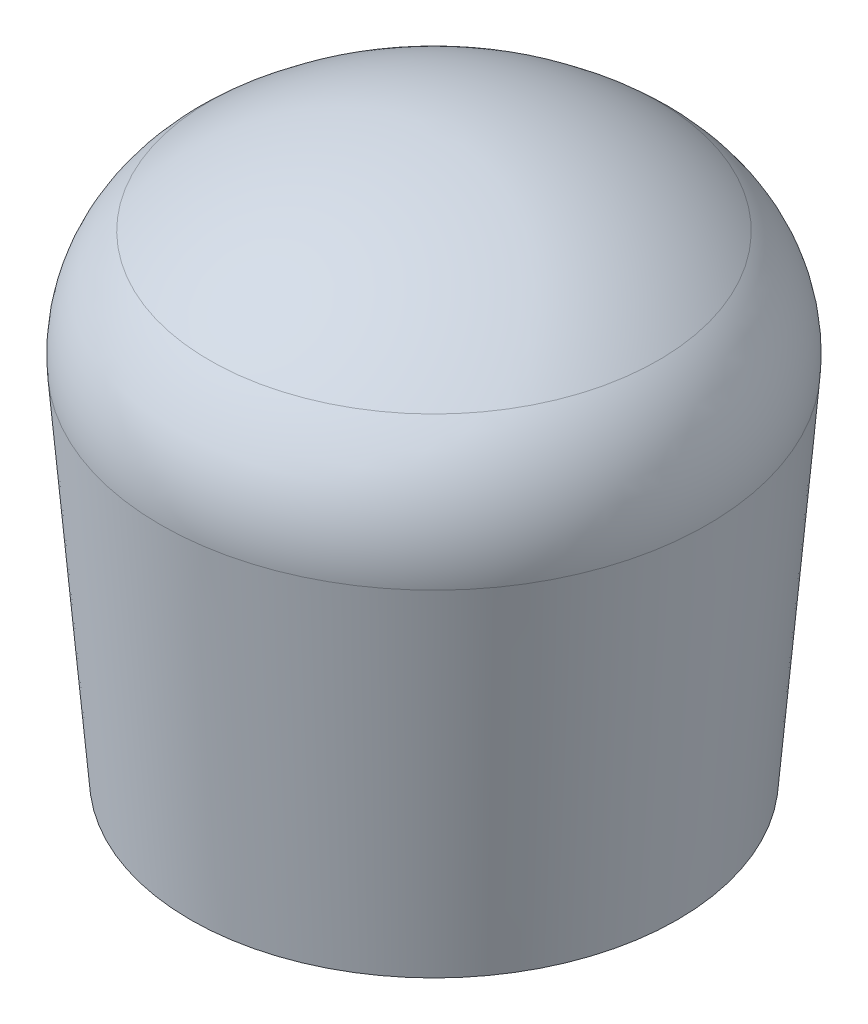
ISO-10303-21;
HEADER;
FILE_DESCRIPTION(('STEP AP214'),'2;1');
FILE_NAME('part.step','',(''),(''),'','','');
FILE_SCHEMA(('AUTOMOTIVE_DESIGN { 1 0 10303 214 1 1 1 1 }'));
ENDSEC;
DATA;
#1=APPLICATION_CONTEXT('core data for automotive mechanical design processes');
#2=APPLICATION_PROTOCOL_DEFINITION('international standard','automotive_design',2000,#1);
#3=PRODUCT_CONTEXT('',#1,'mechanical');
#4=PRODUCT('Part','Part','',(#3));
#5=PRODUCT_RELATED_PRODUCT_CATEGORY('part','',(#4));
#6=PRODUCT_DEFINITION_FORMATION('','',#4);
#7=PRODUCT_DEFINITION_CONTEXT('part definition',#1,'design');
#8=PRODUCT_DEFINITION('design','',#6,#7);
#9=PRODUCT_DEFINITION_SHAPE('','',#8);
#10=(LENGTH_UNIT() NAMED_UNIT(*) SI_UNIT(.MILLI.,.METRE.));
#11=(NAMED_UNIT(*) PLANE_ANGLE_UNIT() SI_UNIT($,.RADIAN.));
#12=(NAMED_UNIT(*) SI_UNIT($,.STERADIAN.) SOLID_ANGLE_UNIT());
#13=UNCERTAINTY_MEASURE_WITH_UNIT(LENGTH_MEASURE(1.E-05),#10,'distance_accuracy_value','');
#14=(GEOMETRIC_REPRESENTATION_CONTEXT(3) GLOBAL_UNCERTAINTY_ASSIGNED_CONTEXT((#13)) GLOBAL_UNIT_ASSIGNED_CONTEXT((#10,
#11,#12)) REPRESENTATION_CONTEXT('',''));
#15=CARTESIAN_POINT('',(0.,0.,0.));
#16=DIRECTION('',(0.,0.,1.));
#17=DIRECTION('',(1.,0.,0.));
#18=AXIS2_PLACEMENT_3D('',#15,#16,#17);
#19=CARTESIAN_POINT('',(0.,3.81,0.));
#20=DIRECTION('',(0.,0.,1.));
#21=DIRECTION('',(1.,0.,0.));
#22=AXIS2_PLACEMENT_3D('',#19,#20,#21);
#23=SPHERICAL_SURFACE('',#22,6.35);
#24=CARTESIAN_POINT('',(0.,3.81,0.));
#25=DIRECTION('',(0.,-1.,0.));
#26=DIRECTION('',(0.,0.,-1.));
#27=AXIS2_PLACEMENT_3D('',#24,#25,#26);
#28=SPHERICAL_SURFACE('',#27,6.35);
#29=CARTESIAN_POINT('',(0.,8.66403899021096,0.));
#30=DIRECTION('',(0.,-1.,0.));
#31=DIRECTION('',(0.,0.,-1.));
#32=AXIS2_PLACEMENT_3D('',#29,#30,#31);
#33=CIRCLE('',#32,4.09399627277697);
#34=CARTESIAN_POINT('',(0.,8.66403899021096,-4.09399627277697));
#35=VERTEX_POINT('',#34);
#36=EDGE_CURVE('E42',#35,#35,#33,.F.);
#37=ORIENTED_EDGE('',*,*,#36,.T.);
#38=EDGE_LOOP('',(#37));
#39=FACE_BOUND('',#38,.T.);
#40=ADVANCED_FACE('F35',(#39),#28,.T.);
#41=CARTESIAN_POINT('',(0.,0.,0.));
#42=DIRECTION('',(0.,1.,0.));
#43=DIRECTION('',(0.,0.,1.));
#44=AXIS2_PLACEMENT_3D('',#41,#42,#43);
#45=PLANE('',#44);
#46=CARTESIAN_POINT('',(0.,0.,0.));
#47=DIRECTION('',(0.,-1.,0.));
#48=DIRECTION('',(0.,0.,-1.));
#49=AXIS2_PLACEMENT_3D('',#46,#47,#48);
#50=CIRCLE('',#49,4.0005);
#51=CARTESIAN_POINT('',(0.,0.,-4.0005));
#52=VERTEX_POINT('',#51);
#53=EDGE_CURVE('E87',#52,#52,#50,.T.);
#54=ORIENTED_EDGE('',*,*,#53,.F.);
#55=EDGE_LOOP('',(#54));
#56=FACE_BOUND('',#55,.T.);
#57=CARTESIAN_POINT('',(0.,0.,0.));
#58=DIRECTION('',(0.,1.,0.));
#59=DIRECTION('',(0.,0.,1.));
#60=AXIS2_PLACEMENT_3D('',#57,#58,#59);
#61=CIRCLE('',#60,4.445);
#62=CARTESIAN_POINT('',(0.,0.,4.445));
#63=VERTEX_POINT('',#62);
#64=EDGE_CURVE('E46',#63,#63,#61,.T.);
#65=ORIENTED_EDGE('',*,*,#64,.F.);
#66=EDGE_LOOP('',(#65));
#67=FACE_BOUND('',#66,.T.);
#68=ADVANCED_FACE('F61',(#56,#67),#45,.F.);
#69=CARTESIAN_POINT('',(0.,0.,0.));
#70=DIRECTION('',(0.,1.,0.));
#71=DIRECTION('',(0.,0.,1.));
#72=AXIS2_PLACEMENT_3D('',#69,#70,#71);
#73=CONICAL_SURFACE('',#72,4.445,0.0831412318884417);
#74=CARTESIAN_POINT('',(0.,6.51148787529806,0.));
#75=DIRECTION('',(0.,-1.,0.));
#76=DIRECTION('',(0.,0.,-1.));
#77=AXIS2_PLACEMENT_3D('',#74,#75,#76);
#78=CIRCLE('',#77,4.98762398960817);
#79=CARTESIAN_POINT('',(0.,6.51148787529806,-4.98762398960817));
#80=VERTEX_POINT('',#79);
#81=EDGE_CURVE('E11',#80,#80,#78,.T.);
#82=ORIENTED_EDGE('',*,*,#81,.T.);
#83=EDGE_LOOP('',(#82));
#84=FACE_BOUND('',#83,.T.);
#85=ORIENTED_EDGE('',*,*,#64,.T.);
#86=EDGE_LOOP('',(#85));
#87=FACE_BOUND('',#86,.T.);
#88=ADVANCED_FACE('F71',(#84,#87),#73,.T.);
#89=CARTESIAN_POINT('',(0.,6.72242339412657,0.));
#90=DIRECTION('',(0.,-1.,0.));
#91=DIRECTION('',(0.,0.,-1.));
#92=AXIS2_PLACEMENT_3D('',#89,#90,#91);
#93=DEGENERATE_TOROIDAL_SURFACE('',#92,2.45639776366618,2.54,.T.);
#94=ORIENTED_EDGE('',*,*,#81,.F.);
#95=EDGE_LOOP('',(#94));
#96=FACE_BOUND('',#95,.T.);
#97=ORIENTED_EDGE('',*,*,#36,.F.);
#98=EDGE_LOOP('',(#97));
#99=FACE_BOUND('',#98,.T.);
#100=ADVANCED_FACE('F37',(#96,#99),#93,.T.);
#101=CARTESIAN_POINT('',(0.,6.35,0.));
#102=DIRECTION('',(0.,-1.,0.));
#103=DIRECTION('',(0.,0.,-1.));
#104=AXIS2_PLACEMENT_3D('',#101,#102,#103);
#105=CYLINDRICAL_SURFACE('',#104,4.0005);
#106=CARTESIAN_POINT('',(0.,6.35,0.));
#107=DIRECTION('',(0.,-1.,0.));
#108=DIRECTION('',(0.,0.,-1.));
#109=AXIS2_PLACEMENT_3D('',#106,#107,#108);
#110=CIRCLE('',#109,4.0005);
#111=CARTESIAN_POINT('',(0.,6.35,-4.0005));
#112=VERTEX_POINT('',#111);
#113=EDGE_CURVE('E50',#112,#112,#110,.T.);
#114=ORIENTED_EDGE('',*,*,#113,.F.);
#115=EDGE_LOOP('',(#114));
#116=FACE_BOUND('',#115,.T.);
#117=ORIENTED_EDGE('',*,*,#53,.T.);
#118=EDGE_LOOP('',(#117));
#119=FACE_BOUND('',#118,.T.);
#120=ADVANCED_FACE('F73',(#116,#119),#105,.F.);
#121=CARTESIAN_POINT('',(0.,6.35,0.));
#122=DIRECTION('',(0.,-1.,0.));
#123=DIRECTION('',(0.,0.,-1.));
#124=AXIS2_PLACEMENT_3D('',#121,#122,#123);
#125=PLANE('',#124);
#126=ORIENTED_EDGE('',*,*,#113,.T.);
#127=EDGE_LOOP('',(#126));
#128=FACE_BOUND('',#127,.T.);
#129=ADVANCED_FACE('F93',(#128),#125,.T.);
#130=CLOSED_SHELL('',(#40,#68,#88,#100,#120,#129));
#131=MANIFOLD_SOLID_BREP('B2',#130);
#132=ADVANCED_BREP_SHAPE_REPRESENTATION('',(#18,#131),#14);
#133=SHAPE_DEFINITION_REPRESENTATION(#9,#132);
ENDSEC;
END-ISO-10303-21;
